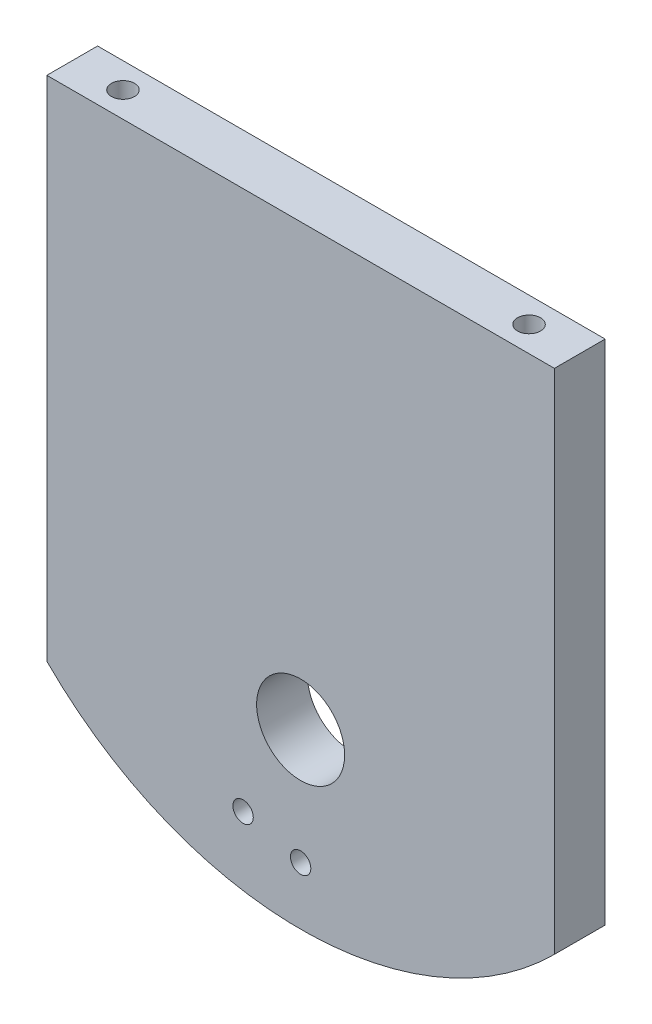
ISO-10303-21;
HEADER;
FILE_DESCRIPTION(('STEP AP214'),'2;1');
FILE_NAME('part.step','',(''),(''),'','','');
FILE_SCHEMA(('AUTOMOTIVE_DESIGN { 1 0 10303 214 1 1 1 1 }'));
ENDSEC;
DATA;
#1=APPLICATION_CONTEXT('core data for automotive mechanical design processes');
#2=APPLICATION_PROTOCOL_DEFINITION('international standard','automotive_design',2000,#1);
#3=PRODUCT_CONTEXT('',#1,'mechanical');
#4=PRODUCT('Part','Part','',(#3));
#5=PRODUCT_RELATED_PRODUCT_CATEGORY('part','',(#4));
#6=PRODUCT_DEFINITION_FORMATION('','',#4);
#7=PRODUCT_DEFINITION_CONTEXT('part definition',#1,'design');
#8=PRODUCT_DEFINITION('design','',#6,#7);
#9=PRODUCT_DEFINITION_SHAPE('','',#8);
#10=(LENGTH_UNIT() NAMED_UNIT(*) SI_UNIT(.MILLI.,.METRE.));
#11=(NAMED_UNIT(*) PLANE_ANGLE_UNIT() SI_UNIT($,.RADIAN.));
#12=(NAMED_UNIT(*) SI_UNIT($,.STERADIAN.) SOLID_ANGLE_UNIT());
#13=UNCERTAINTY_MEASURE_WITH_UNIT(LENGTH_MEASURE(1.E-05),#10,'distance_accuracy_value','');
#14=(GEOMETRIC_REPRESENTATION_CONTEXT(3) GLOBAL_UNCERTAINTY_ASSIGNED_CONTEXT((#13)) GLOBAL_UNIT_ASSIGNED_CONTEXT((#10,
#11,#12)) REPRESENTATION_CONTEXT('',''));
#15=CARTESIAN_POINT('',(0.,0.,0.));
#16=DIRECTION('',(0.,0.,1.));
#17=DIRECTION('',(1.,0.,0.));
#18=AXIS2_PLACEMENT_3D('',#15,#16,#17);
#19=CARTESIAN_POINT('',(-75.,0.,15.));
#20=DIRECTION('',(-1.,0.,0.));
#21=DIRECTION('',(0.,0.,1.));
#22=AXIS2_PLACEMENT_3D('',#19,#20,#21);
#23=PLANE('',#22);
#24=DIRECTION('',(0.,1.,0.));
#25=VECTOR('',#24,1.);
#26=CARTESIAN_POINT('',(-75.,0.,0.));
#27=LINE('',#26,#25);
#28=CARTESIAN_POINT('',(-75.,-105.,0.));
#29=VERTEX_POINT('',#28);
#30=CARTESIAN_POINT('',(-75.,45.,0.));
#31=VERTEX_POINT('',#30);
#32=EDGE_CURVE('E137',#29,#31,#27,.T.);
#33=ORIENTED_EDGE('',*,*,#32,.F.);
#34=DIRECTION('',(0.,0.,-1.));
#35=VECTOR('',#34,1.);
#36=CARTESIAN_POINT('',(-75.,-105.,15.));
#37=LINE('',#36,#35);
#38=CARTESIAN_POINT('',(-75.,-105.,15.));
#39=VERTEX_POINT('',#38);
#40=EDGE_CURVE('E11',#39,#29,#37,.T.);
#41=ORIENTED_EDGE('',*,*,#40,.F.);
#42=DIRECTION('',(0.,1.,0.));
#43=VECTOR('',#42,1.);
#44=CARTESIAN_POINT('',(-75.,0.,15.));
#45=LINE('',#44,#43);
#46=CARTESIAN_POINT('',(-75.,45.,15.));
#47=VERTEX_POINT('',#46);
#48=EDGE_CURVE('E140',#39,#47,#45,.T.);
#49=ORIENTED_EDGE('',*,*,#48,.T.);
#50=DIRECTION('',(0.,0.,-1.));
#51=VECTOR('',#50,1.);
#52=CARTESIAN_POINT('',(-75.,45.,15.));
#53=LINE('',#52,#51);
#54=EDGE_CURVE('E51',#47,#31,#53,.T.);
#55=ORIENTED_EDGE('',*,*,#54,.T.);
#56=EDGE_LOOP('',(#33,#41,#49,#55));
#57=FACE_BOUND('',#56,.T.);
#58=ADVANCED_FACE('F35',(#57),#23,.T.);
#59=CARTESIAN_POINT('',(0.,-30.,15.));
#60=DIRECTION('',(0.,0.,-1.));
#61=DIRECTION('',(-1.,0.,0.));
#62=AXIS2_PLACEMENT_3D('',#59,#60,#61);
#63=CYLINDRICAL_SURFACE('',#62,106.066017177982);
#64=CARTESIAN_POINT('',(0.,-30.,0.));
#65=DIRECTION('',(0.,0.,1.));
#66=DIRECTION('',(1.,0.,0.));
#67=AXIS2_PLACEMENT_3D('',#64,#65,#66);
#68=CIRCLE('',#67,106.066017177982);
#69=CARTESIAN_POINT('',(75.,-105.,0.));
#70=VERTEX_POINT('',#69);
#71=EDGE_CURVE('E150',#29,#70,#68,.T.);
#72=ORIENTED_EDGE('',*,*,#71,.T.);
#73=DIRECTION('',(0.,0.,-1.));
#74=VECTOR('',#73,1.);
#75=CARTESIAN_POINT('',(75.,-105.,15.));
#76=LINE('',#75,#74);
#77=CARTESIAN_POINT('',(75.,-105.,15.));
#78=VERTEX_POINT('',#77);
#79=EDGE_CURVE('E43',#78,#70,#76,.T.);
#80=ORIENTED_EDGE('',*,*,#79,.F.);
#81=CARTESIAN_POINT('',(0.,-30.,15.));
#82=DIRECTION('',(0.,0.,1.));
#83=DIRECTION('',(1.,0.,0.));
#84=AXIS2_PLACEMENT_3D('',#81,#82,#83);
#85=CIRCLE('',#84,106.066017177982);
#86=EDGE_CURVE('E142',#39,#78,#85,.T.);
#87=ORIENTED_EDGE('',*,*,#86,.F.);
#88=ORIENTED_EDGE('',*,*,#40,.T.);
#89=EDGE_LOOP('',(#72,#80,#87,#88));
#90=FACE_BOUND('',#89,.T.);
#91=ADVANCED_FACE('F178',(#90),#63,.T.);
#92=CARTESIAN_POINT('',(75.,0.,15.));
#93=DIRECTION('',(-1.,0.,0.));
#94=DIRECTION('',(0.,0.,1.));
#95=AXIS2_PLACEMENT_3D('',#92,#93,#94);
#96=PLANE('',#95);
#97=DIRECTION('',(0.,1.,0.));
#98=VECTOR('',#97,1.);
#99=CARTESIAN_POINT('',(75.,0.,0.));
#100=LINE('',#99,#98);
#101=CARTESIAN_POINT('',(75.,45.,0.));
#102=VERTEX_POINT('',#101);
#103=EDGE_CURVE('E152',#70,#102,#100,.T.);
#104=ORIENTED_EDGE('',*,*,#103,.T.);
#105=DIRECTION('',(0.,0.,-1.));
#106=VECTOR('',#105,1.);
#107=CARTESIAN_POINT('',(75.,45.,15.));
#108=LINE('',#107,#106);
#109=CARTESIAN_POINT('',(75.,45.,15.));
#110=VERTEX_POINT('',#109);
#111=EDGE_CURVE('E66',#110,#102,#108,.T.);
#112=ORIENTED_EDGE('',*,*,#111,.F.);
#113=DIRECTION('',(0.,1.,0.));
#114=VECTOR('',#113,1.);
#115=CARTESIAN_POINT('',(75.,0.,15.));
#116=LINE('',#115,#114);
#117=EDGE_CURVE('E145',#78,#110,#116,.T.);
#118=ORIENTED_EDGE('',*,*,#117,.F.);
#119=ORIENTED_EDGE('',*,*,#79,.T.);
#120=EDGE_LOOP('',(#104,#112,#118,#119));
#121=FACE_BOUND('',#120,.T.);
#122=ADVANCED_FACE('F162',(#121),#96,.F.);
#123=CARTESIAN_POINT('',(0.,45.,15.));
#124=DIRECTION('',(0.,1.,0.));
#125=DIRECTION('',(0.,0.,1.));
#126=AXIS2_PLACEMENT_3D('',#123,#124,#125);
#127=PLANE('',#126);
#128=CARTESIAN_POINT('',(-60.,45.,7.5));
#129=DIRECTION('',(0.,1.,0.));
#130=DIRECTION('',(0.,0.,1.));
#131=AXIS2_PLACEMENT_3D('',#128,#129,#130);
#132=CIRCLE('',#131,3.39999999999999);
#133=CARTESIAN_POINT('',(-60.,45.,10.9));
#134=VERTEX_POINT('',#133);
#135=EDGE_CURVE('E99',#134,#134,#132,.T.);
#136=ORIENTED_EDGE('',*,*,#135,.F.);
#137=EDGE_LOOP('',(#136));
#138=FACE_BOUND('',#137,.T.);
#139=CARTESIAN_POINT('',(60.,45.,7.5));
#140=DIRECTION('',(0.,1.,0.));
#141=DIRECTION('',(0.,0.,1.));
#142=AXIS2_PLACEMENT_3D('',#139,#140,#141);
#143=CIRCLE('',#142,3.39999999999999);
#144=CARTESIAN_POINT('',(60.,45.,10.9));
#145=VERTEX_POINT('',#144);
#146=EDGE_CURVE('E98',#145,#145,#143,.T.);
#147=ORIENTED_EDGE('',*,*,#146,.F.);
#148=EDGE_LOOP('',(#147));
#149=FACE_BOUND('',#148,.T.);
#150=DIRECTION('',(1.,0.,0.));
#151=VECTOR('',#150,1.);
#152=CARTESIAN_POINT('',(0.,45.,0.));
#153=LINE('',#152,#151);
#154=EDGE_CURVE('E143',#31,#102,#153,.T.);
#155=ORIENTED_EDGE('',*,*,#154,.F.);
#156=ORIENTED_EDGE('',*,*,#54,.F.);
#157=DIRECTION('',(1.,0.,0.));
#158=VECTOR('',#157,1.);
#159=CARTESIAN_POINT('',(0.,45.,15.));
#160=LINE('',#159,#158);
#161=EDGE_CURVE('E147',#47,#110,#160,.T.);
#162=ORIENTED_EDGE('',*,*,#161,.T.);
#163=ORIENTED_EDGE('',*,*,#111,.T.);
#164=EDGE_LOOP('',(#155,#156,#162,#163));
#165=FACE_BOUND('',#164,.T.);
#166=ADVANCED_FACE('F167',(#138,#149,#165),#127,.T.);
#167=CARTESIAN_POINT('',(0.,0.,15.));
#168=DIRECTION('',(0.,0.,1.));
#169=DIRECTION('',(1.,0.,0.));
#170=AXIS2_PLACEMENT_3D('',#167,#168,#169);
#171=PLANE('',#170);
#172=CARTESIAN_POINT('',(-16.9999999999998,-114.444863728671,15.));
#173=DIRECTION('',(0.,0.,1.));
#174=DIRECTION('',(1.,0.,0.));
#175=AXIS2_PLACEMENT_3D('',#172,#173,#174);
#176=CIRCLE('',#175,3.01000000000024);
#177=CARTESIAN_POINT('',(-13.9899999999996,-114.444863728671,15.));
#178=VERTEX_POINT('',#177);
#179=EDGE_CURVE('E121',#178,#178,#176,.T.);
#180=ORIENTED_EDGE('',*,*,#179,.F.);
#181=EDGE_LOOP('',(#180));
#182=FACE_BOUND('',#181,.T.);
#183=CARTESIAN_POINT('',(0.,-119.,15.));
#184=DIRECTION('',(0.,0.,1.));
#185=DIRECTION('',(1.,0.,0.));
#186=AXIS2_PLACEMENT_3D('',#183,#184,#185);
#187=CIRCLE('',#186,3.01);
#188=CARTESIAN_POINT('',(3.01000000000002,-119.,15.));
#189=VERTEX_POINT('',#188);
#190=EDGE_CURVE('E125',#189,#189,#187,.T.);
#191=ORIENTED_EDGE('',*,*,#190,.F.);
#192=EDGE_LOOP('',(#191));
#193=FACE_BOUND('',#192,.T.);
#194=CARTESIAN_POINT('',(0.,-85.,15.));
#195=DIRECTION('',(0.,0.,1.));
#196=DIRECTION('',(1.,0.,0.));
#197=AXIS2_PLACEMENT_3D('',#194,#195,#196);
#198=CIRCLE('',#197,13.005);
#199=CARTESIAN_POINT('',(13.005,-85.,15.));
#200=VERTEX_POINT('',#199);
#201=EDGE_CURVE('E131',#200,#200,#198,.T.);
#202=ORIENTED_EDGE('',*,*,#201,.F.);
#203=EDGE_LOOP('',(#202));
#204=FACE_BOUND('',#203,.T.);
#205=ORIENTED_EDGE('',*,*,#48,.F.);
#206=ORIENTED_EDGE('',*,*,#86,.T.);
#207=ORIENTED_EDGE('',*,*,#117,.T.);
#208=ORIENTED_EDGE('',*,*,#161,.F.);
#209=EDGE_LOOP('',(#205,#206,#207,#208));
#210=FACE_BOUND('',#209,.T.);
#211=ADVANCED_FACE('F169',(#182,#193,#204,#210),#171,.T.);
#212=CARTESIAN_POINT('',(0.,0.,0.));
#213=DIRECTION('',(0.,0.,1.));
#214=DIRECTION('',(1.,0.,0.));
#215=AXIS2_PLACEMENT_3D('',#212,#213,#214);
#216=PLANE('',#215);
#217=CARTESIAN_POINT('',(37.5,-50.,0.));
#218=DIRECTION('',(0.,0.,-1.));
#219=DIRECTION('',(-1.,0.,0.));
#220=AXIS2_PLACEMENT_3D('',#217,#218,#219);
#221=CIRCLE('',#220,3.4);
#222=CARTESIAN_POINT('',(34.1,-50.,0.));
#223=VERTEX_POINT('',#222);
#224=EDGE_CURVE('E109',#223,#223,#221,.T.);
#225=ORIENTED_EDGE('',*,*,#224,.F.);
#226=EDGE_LOOP('',(#225));
#227=FACE_BOUND('',#226,.T.);
#228=CARTESIAN_POINT('',(-37.5,-50.,0.));
#229=DIRECTION('',(0.,0.,-1.));
#230=DIRECTION('',(-1.,0.,0.));
#231=AXIS2_PLACEMENT_3D('',#228,#229,#230);
#232=CIRCLE('',#231,3.4);
#233=CARTESIAN_POINT('',(-40.9,-50.,0.));
#234=VERTEX_POINT('',#233);
#235=EDGE_CURVE('E115',#234,#234,#232,.T.);
#236=ORIENTED_EDGE('',*,*,#235,.F.);
#237=EDGE_LOOP('',(#236));
#238=FACE_BOUND('',#237,.T.);
#239=CARTESIAN_POINT('',(-16.9999999999998,-114.444863728671,0.));
#240=DIRECTION('',(0.,0.,1.));
#241=DIRECTION('',(1.,0.,0.));
#242=AXIS2_PLACEMENT_3D('',#239,#240,#241);
#243=CIRCLE('',#242,3.01000000000024);
#244=CARTESIAN_POINT('',(-13.9899999999996,-114.444863728671,0.));
#245=VERTEX_POINT('',#244);
#246=EDGE_CURVE('E122',#245,#245,#243,.T.);
#247=ORIENTED_EDGE('',*,*,#246,.T.);
#248=EDGE_LOOP('',(#247));
#249=FACE_BOUND('',#248,.T.);
#250=CARTESIAN_POINT('',(0.,-119.,0.));
#251=DIRECTION('',(0.,0.,1.));
#252=DIRECTION('',(1.,0.,0.));
#253=AXIS2_PLACEMENT_3D('',#250,#251,#252);
#254=CIRCLE('',#253,3.01);
#255=CARTESIAN_POINT('',(3.01000000000002,-119.,0.));
#256=VERTEX_POINT('',#255);
#257=EDGE_CURVE('E128',#256,#256,#254,.T.);
#258=ORIENTED_EDGE('',*,*,#257,.T.);
#259=EDGE_LOOP('',(#258));
#260=FACE_BOUND('',#259,.T.);
#261=CARTESIAN_POINT('',(0.,-85.,0.));
#262=DIRECTION('',(0.,0.,1.));
#263=DIRECTION('',(1.,0.,0.));
#264=AXIS2_PLACEMENT_3D('',#261,#262,#263);
#265=CIRCLE('',#264,13.005);
#266=CARTESIAN_POINT('',(13.005,-85.,0.));
#267=VERTEX_POINT('',#266);
#268=EDGE_CURVE('E134',#267,#267,#265,.T.);
#269=ORIENTED_EDGE('',*,*,#268,.T.);
#270=EDGE_LOOP('',(#269));
#271=FACE_BOUND('',#270,.T.);
#272=ORIENTED_EDGE('',*,*,#32,.T.);
#273=ORIENTED_EDGE('',*,*,#154,.T.);
#274=ORIENTED_EDGE('',*,*,#103,.F.);
#275=ORIENTED_EDGE('',*,*,#71,.F.);
#276=EDGE_LOOP('',(#272,#273,#274,#275));
#277=FACE_BOUND('',#276,.T.);
#278=ADVANCED_FACE('F166',(#227,#238,#249,#260,#271,#277),#216,.F.);
#279=CARTESIAN_POINT('',(0.,-85.,0.));
#280=DIRECTION('',(0.,0.,1.));
#281=DIRECTION('',(1.,0.,0.));
#282=AXIS2_PLACEMENT_3D('',#279,#280,#281);
#283=CYLINDRICAL_SURFACE('',#282,13.005);
#284=ORIENTED_EDGE('',*,*,#268,.F.);
#285=EDGE_LOOP('',(#284));
#286=FACE_BOUND('',#285,.T.);
#287=ORIENTED_EDGE('',*,*,#201,.T.);
#288=EDGE_LOOP('',(#287));
#289=FACE_BOUND('',#288,.T.);
#290=ADVANCED_FACE('F212',(#286,#289),#283,.F.);
#291=CARTESIAN_POINT('',(0.,-119.,0.));
#292=DIRECTION('',(0.,0.,1.));
#293=DIRECTION('',(1.,0.,0.));
#294=AXIS2_PLACEMENT_3D('',#291,#292,#293);
#295=CYLINDRICAL_SURFACE('',#294,3.01);
#296=ORIENTED_EDGE('',*,*,#257,.F.);
#297=EDGE_LOOP('',(#296));
#298=FACE_BOUND('',#297,.T.);
#299=ORIENTED_EDGE('',*,*,#190,.T.);
#300=EDGE_LOOP('',(#299));
#301=FACE_BOUND('',#300,.T.);
#302=ADVANCED_FACE('F217',(#298,#301),#295,.F.);
#303=CARTESIAN_POINT('',(-16.9999999999998,-114.444863728671,0.));
#304=DIRECTION('',(0.,0.,1.));
#305=DIRECTION('',(1.,0.,0.));
#306=AXIS2_PLACEMENT_3D('',#303,#304,#305);
#307=CYLINDRICAL_SURFACE('',#306,3.01000000000024);
#308=ORIENTED_EDGE('',*,*,#246,.F.);
#309=EDGE_LOOP('',(#308));
#310=FACE_BOUND('',#309,.T.);
#311=ORIENTED_EDGE('',*,*,#179,.T.);
#312=EDGE_LOOP('',(#311));
#313=FACE_BOUND('',#312,.T.);
#314=ADVANCED_FACE('F228',(#310,#313),#307,.F.);
#315=CARTESIAN_POINT('',(-37.5,-50.,10.));
#316=DIRECTION('',(0.,0.,-1.));
#317=DIRECTION('',(-1.,0.,0.));
#318=AXIS2_PLACEMENT_3D('',#315,#316,#317);
#319=CONICAL_SURFACE('',#318,3.39999999999999,1.02974425867665);
#320=CARTESIAN_POINT('',(-37.5,-50.,12.0429261046937));
#321=VERTEX_POINT('',#320);
#322=VERTEX_LOOP('',#321);
#323=FACE_BOUND('',#322,.T.);
#324=CARTESIAN_POINT('',(-37.5,-50.,10.));
#325=DIRECTION('',(0.,0.,-1.));
#326=DIRECTION('',(-1.,0.,0.));
#327=AXIS2_PLACEMENT_3D('',#324,#325,#326);
#328=CIRCLE('',#327,3.39999999999999);
#329=CARTESIAN_POINT('',(-40.9,-50.,10.));
#330=VERTEX_POINT('',#329);
#331=EDGE_CURVE('E118',#330,#330,#328,.T.);
#332=ORIENTED_EDGE('',*,*,#331,.T.);
#333=EDGE_LOOP('',(#332));
#334=FACE_BOUND('',#333,.T.);
#335=ADVANCED_FACE('F238',(#323,#334),#319,.F.);
#336=CARTESIAN_POINT('',(-37.5,-50.,0.));
#337=DIRECTION('',(0.,0.,-1.));
#338=DIRECTION('',(-1.,0.,0.));
#339=AXIS2_PLACEMENT_3D('',#336,#337,#338);
#340=CYLINDRICAL_SURFACE('',#339,3.4);
#341=ORIENTED_EDGE('',*,*,#331,.F.);
#342=EDGE_LOOP('',(#341));
#343=FACE_BOUND('',#342,.T.);
#344=ORIENTED_EDGE('',*,*,#235,.T.);
#345=EDGE_LOOP('',(#344));
#346=FACE_BOUND('',#345,.T.);
#347=ADVANCED_FACE('F255',(#343,#346),#340,.F.);
#348=CARTESIAN_POINT('',(37.5,-50.,10.));
#349=DIRECTION('',(0.,0.,-1.));
#350=DIRECTION('',(-1.,0.,0.));
#351=AXIS2_PLACEMENT_3D('',#348,#349,#350);
#352=CONICAL_SURFACE('',#351,3.39999999999999,1.02974425867665);
#353=CARTESIAN_POINT('',(37.5,-50.,12.0429261046937));
#354=VERTEX_POINT('',#353);
#355=VERTEX_LOOP('',#354);
#356=FACE_BOUND('',#355,.T.);
#357=CARTESIAN_POINT('',(37.5,-50.,10.));
#358=DIRECTION('',(0.,0.,-1.));
#359=DIRECTION('',(-1.,0.,0.));
#360=AXIS2_PLACEMENT_3D('',#357,#358,#359);
#361=CIRCLE('',#360,3.39999999999999);
#362=CARTESIAN_POINT('',(34.1,-50.,10.));
#363=VERTEX_POINT('',#362);
#364=EDGE_CURVE('E112',#363,#363,#361,.T.);
#365=ORIENTED_EDGE('',*,*,#364,.T.);
#366=EDGE_LOOP('',(#365));
#367=FACE_BOUND('',#366,.T.);
#368=ADVANCED_FACE('F265',(#356,#367),#352,.F.);
#369=CARTESIAN_POINT('',(37.5,-50.,0.));
#370=DIRECTION('',(0.,0.,-1.));
#371=DIRECTION('',(-1.,0.,0.));
#372=AXIS2_PLACEMENT_3D('',#369,#370,#371);
#373=CYLINDRICAL_SURFACE('',#372,3.4);
#374=ORIENTED_EDGE('',*,*,#364,.F.);
#375=EDGE_LOOP('',(#374));
#376=FACE_BOUND('',#375,.T.);
#377=ORIENTED_EDGE('',*,*,#224,.T.);
#378=EDGE_LOOP('',(#377));
#379=FACE_BOUND('',#378,.T.);
#380=ADVANCED_FACE('F275',(#376,#379),#373,.F.);
#381=CARTESIAN_POINT('',(60.,5.,7.5));
#382=DIRECTION('',(0.,1.,0.));
#383=DIRECTION('',(0.,0.,1.));
#384=AXIS2_PLACEMENT_3D('',#381,#382,#383);
#385=CONICAL_SURFACE('',#384,3.39999999999999,1.02974425867665);
#386=CARTESIAN_POINT('',(60.,2.9570738953063,7.5));
#387=VERTEX_POINT('',#386);
#388=VERTEX_LOOP('',#387);
#389=FACE_BOUND('',#388,.T.);
#390=CARTESIAN_POINT('',(60.,5.,7.5));
#391=DIRECTION('',(0.,1.,0.));
#392=DIRECTION('',(0.,0.,1.));
#393=AXIS2_PLACEMENT_3D('',#390,#391,#392);
#394=CIRCLE('',#393,3.39999999999999);
#395=CARTESIAN_POINT('',(60.,5.,10.9));
#396=VERTEX_POINT('',#395);
#397=EDGE_CURVE('E102',#396,#396,#394,.T.);
#398=ORIENTED_EDGE('',*,*,#397,.T.);
#399=EDGE_LOOP('',(#398));
#400=FACE_BOUND('',#399,.T.);
#401=ADVANCED_FACE('F284',(#389,#400),#385,.F.);
#402=CARTESIAN_POINT('',(60.,45.,7.5));
#403=DIRECTION('',(0.,1.,0.));
#404=DIRECTION('',(0.,0.,1.));
#405=AXIS2_PLACEMENT_3D('',#402,#403,#404);
#406=CYLINDRICAL_SURFACE('',#405,3.39999999999999);
#407=ORIENTED_EDGE('',*,*,#397,.F.);
#408=EDGE_LOOP('',(#407));
#409=FACE_BOUND('',#408,.T.);
#410=ORIENTED_EDGE('',*,*,#146,.T.);
#411=EDGE_LOOP('',(#410));
#412=FACE_BOUND('',#411,.T.);
#413=ADVANCED_FACE('F92',(#409,#412),#406,.F.);
#414=CARTESIAN_POINT('',(-60.,5.,7.5));
#415=DIRECTION('',(0.,1.,0.));
#416=DIRECTION('',(0.,0.,1.));
#417=AXIS2_PLACEMENT_3D('',#414,#415,#416);
#418=CONICAL_SURFACE('',#417,3.39999999999999,1.02974425867665);
#419=CARTESIAN_POINT('',(-60.,2.9570738953063,7.5));
#420=VERTEX_POINT('',#419);
#421=VERTEX_LOOP('',#420);
#422=FACE_BOUND('',#421,.T.);
#423=CARTESIAN_POINT('',(-60.,5.,7.5));
#424=DIRECTION('',(0.,1.,0.));
#425=DIRECTION('',(0.,0.,1.));
#426=AXIS2_PLACEMENT_3D('',#423,#424,#425);
#427=CIRCLE('',#426,3.39999999999999);
#428=CARTESIAN_POINT('',(-60.,5.,10.9));
#429=VERTEX_POINT('',#428);
#430=EDGE_CURVE('E96',#429,#429,#427,.T.);
#431=ORIENTED_EDGE('',*,*,#430,.T.);
#432=EDGE_LOOP('',(#431));
#433=FACE_BOUND('',#432,.T.);
#434=ADVANCED_FACE('F88',(#422,#433),#418,.F.);
#435=CARTESIAN_POINT('',(-60.,45.,7.5));
#436=DIRECTION('',(0.,1.,0.));
#437=DIRECTION('',(0.,0.,1.));
#438=AXIS2_PLACEMENT_3D('',#435,#436,#437);
#439=CYLINDRICAL_SURFACE('',#438,3.39999999999999);
#440=ORIENTED_EDGE('',*,*,#430,.F.);
#441=EDGE_LOOP('',(#440));
#442=FACE_BOUND('',#441,.T.);
#443=ORIENTED_EDGE('',*,*,#135,.T.);
#444=EDGE_LOOP('',(#443));
#445=FACE_BOUND('',#444,.T.);
#446=ADVANCED_FACE('F91',(#442,#445),#439,.F.);
#447=CLOSED_SHELL('',(#58,#91,#122,#166,#211,#278,#290,#302,#314,#335,#347,#368,#380,#401,#413,
#434,#446));
#448=MANIFOLD_SOLID_BREP('B2',#447);
#449=ADVANCED_BREP_SHAPE_REPRESENTATION('',(#18,#448),#14);
#450=SHAPE_DEFINITION_REPRESENTATION(#9,#449);
ENDSEC;
END-ISO-10303-21;
